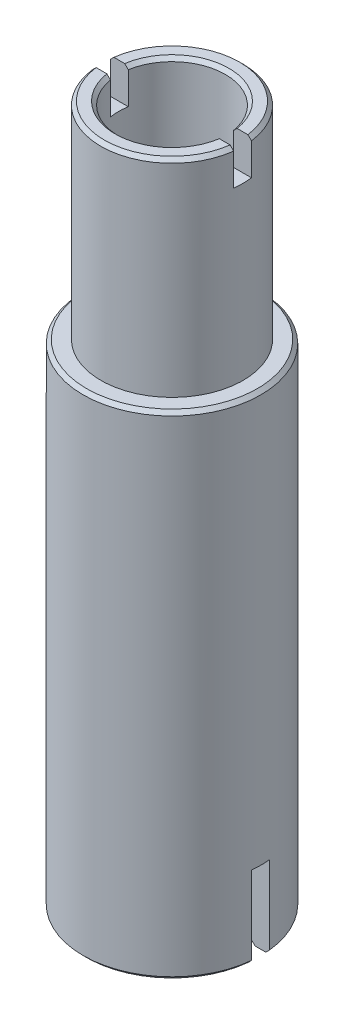
ISO-10303-21;
HEADER;
FILE_DESCRIPTION(('STEP AP214'),'2;1');
FILE_NAME('part.step','',(''),(''),'','','');
FILE_SCHEMA(('AUTOMOTIVE_DESIGN { 1 0 10303 214 1 1 1 1 }'));
ENDSEC;
DATA;
#1=APPLICATION_CONTEXT('core data for automotive mechanical design processes');
#2=APPLICATION_PROTOCOL_DEFINITION('international standard','automotive_design',2000,#1);
#3=PRODUCT_CONTEXT('',#1,'mechanical');
#4=PRODUCT('Part','Part','',(#3));
#5=PRODUCT_RELATED_PRODUCT_CATEGORY('part','',(#4));
#6=PRODUCT_DEFINITION_FORMATION('','',#4);
#7=PRODUCT_DEFINITION_CONTEXT('part definition',#1,'design');
#8=PRODUCT_DEFINITION('design','',#6,#7);
#9=PRODUCT_DEFINITION_SHAPE('','',#8);
#10=(LENGTH_UNIT() NAMED_UNIT(*) SI_UNIT(.MILLI.,.METRE.));
#11=(NAMED_UNIT(*) PLANE_ANGLE_UNIT() SI_UNIT($,.RADIAN.));
#12=(NAMED_UNIT(*) SI_UNIT($,.STERADIAN.) SOLID_ANGLE_UNIT());
#13=UNCERTAINTY_MEASURE_WITH_UNIT(LENGTH_MEASURE(1.E-05),#10,'distance_accuracy_value','');
#14=(GEOMETRIC_REPRESENTATION_CONTEXT(3) GLOBAL_UNCERTAINTY_ASSIGNED_CONTEXT((#13)) GLOBAL_UNIT_ASSIGNED_CONTEXT((#10,
#11,#12)) REPRESENTATION_CONTEXT('',''));
#15=CARTESIAN_POINT('',(0.,0.,0.));
#16=DIRECTION('',(0.,0.,1.));
#17=DIRECTION('',(1.,0.,0.));
#18=AXIS2_PLACEMENT_3D('',#15,#16,#17);
#19=CARTESIAN_POINT('',(20.,-138.5,0.));
#20=DIRECTION('',(0.,-1.,0.));
#21=DIRECTION('',(0.,0.,-1.));
#22=AXIS2_PLACEMENT_3D('',#19,#20,#21);
#23=PLANE('',#22);
#24=DIRECTION('',(1.,0.,0.));
#25=VECTOR('',#24,1.);
#26=CARTESIAN_POINT('',(-35.,-138.5,-2.5));
#27=LINE('',#26,#25);
#28=CARTESIAN_POINT('',(20.850659461993,-138.5,-2.5));
#29=VERTEX_POINT('',#28);
#30=CARTESIAN_POINT('',(23.86943652456,-138.5,-2.5));
#31=VERTEX_POINT('',#30);
#32=EDGE_CURVE('E570',#29,#31,#27,.T.);
#33=ORIENTED_EDGE('',*,*,#32,.F.);
#34=CARTESIAN_POINT('',(0.,-138.5,0.));
#35=DIRECTION('',(0.,-1.,0.));
#36=DIRECTION('',(0.,0.,-1.));
#37=AXIS2_PLACEMENT_3D('',#34,#35,#36);
#38=CIRCLE('',#37,20.9999999999999);
#39=CARTESIAN_POINT('',(-20.850659461993,-138.5,-2.5));
#40=VERTEX_POINT('',#39);
#41=EDGE_CURVE('E301',#29,#40,#38,.F.);
#42=ORIENTED_EDGE('',*,*,#41,.T.);
#43=CARTESIAN_POINT('',(-23.86943652456,-138.5,-2.5));
#44=VERTEX_POINT('',#43);
#45=EDGE_CURVE('E573',#44,#40,#27,.T.);
#46=ORIENTED_EDGE('',*,*,#45,.F.);
#47=CARTESIAN_POINT('',(0.,-138.5,0.));
#48=DIRECTION('',(0.,-1.,0.));
#49=DIRECTION('',(0.,0.,-1.));
#50=AXIS2_PLACEMENT_3D('',#47,#48,#49);
#51=CIRCLE('',#50,24.);
#52=EDGE_CURVE('E641',#44,#31,#51,.T.);
#53=ORIENTED_EDGE('',*,*,#52,.T.);
#54=EDGE_LOOP('',(#33,#42,#46,#53));
#55=FACE_BOUND('',#54,.T.);
#56=ADVANCED_FACE('F34',(#55),#23,.T.);
#57=CARTESIAN_POINT('',(20.,58.,0.));
#58=DIRECTION('',(0.,1.,0.));
#59=DIRECTION('',(0.,0.,1.));
#60=AXIS2_PLACEMENT_3D('',#57,#58,#59);
#61=PLANE('',#60);
#62=DIRECTION('',(1.,0.,0.));
#63=VECTOR('',#62,1.);
#64=CARTESIAN_POINT('',(-27.5,58.,2.5));
#65=LINE('',#64,#63);
#66=CARTESIAN_POINT('',(-18.8348082018373,58.,2.5));
#67=VERTEX_POINT('',#66);
#68=CARTESIAN_POINT('',(-15.8034806292791,58.,2.5));
#69=VERTEX_POINT('',#68);
#70=EDGE_CURVE('E452',#67,#69,#65,.T.);
#71=ORIENTED_EDGE('',*,*,#70,.F.);
#72=CARTESIAN_POINT('',(0.,58.,0.));
#73=DIRECTION('',(0.,1.,0.));
#74=DIRECTION('',(0.,0.,1.));
#75=AXIS2_PLACEMENT_3D('',#72,#73,#74);
#76=CIRCLE('',#75,19.);
#77=CARTESIAN_POINT('',(18.8348082018373,58.,2.5));
#78=VERTEX_POINT('',#77);
#79=EDGE_CURVE('E56',#67,#78,#76,.T.);
#80=ORIENTED_EDGE('',*,*,#79,.T.);
#81=CARTESIAN_POINT('',(15.8034806292791,58.,2.5));
#82=VERTEX_POINT('',#81);
#83=EDGE_CURVE('E453',#82,#78,#65,.T.);
#84=ORIENTED_EDGE('',*,*,#83,.F.);
#85=CARTESIAN_POINT('',(0.,58.,0.));
#86=DIRECTION('',(0.,1.,0.));
#87=DIRECTION('',(0.,0.,1.));
#88=AXIS2_PLACEMENT_3D('',#85,#86,#87);
#89=CIRCLE('',#88,16.);
#90=EDGE_CURVE('E438',#82,#69,#89,.F.);
#91=ORIENTED_EDGE('',*,*,#90,.T.);
#92=EDGE_LOOP('',(#71,#80,#84,#91));
#93=FACE_BOUND('',#92,.T.);
#94=ADVANCED_FACE('F341',(#93),#61,.T.);
#95=CARTESIAN_POINT('',(0.,0.,0.));
#96=DIRECTION('',(0.,-1.,0.));
#97=DIRECTION('',(0.,0.,-1.));
#98=AXIS2_PLACEMENT_3D('',#95,#96,#97);
#99=CYLINDRICAL_SURFACE('',#98,20.);
#100=DIRECTION('',(0.,-1.,0.));
#101=VECTOR('',#100,1.);
#102=CARTESIAN_POINT('',(-19.8431348329844,0.,-2.5));
#103=LINE('',#102,#101);
#104=CARTESIAN_POINT('',(-19.8431348329844,-137.5,-2.5));
#105=VERTEX_POINT('',#104);
#106=CARTESIAN_POINT('',(-19.8431348329844,-115.5,-2.5));
#107=VERTEX_POINT('',#106);
#108=EDGE_CURVE('E224',#105,#107,#103,.F.);
#109=ORIENTED_EDGE('',*,*,#108,.F.);
#110=CARTESIAN_POINT('',(0.,-137.5,0.));
#111=DIRECTION('',(0.,-1.,0.));
#112=DIRECTION('',(0.,0.,-1.));
#113=AXIS2_PLACEMENT_3D('',#110,#111,#112);
#114=CIRCLE('',#113,20.);
#115=CARTESIAN_POINT('',(19.8431348329844,-137.5,-2.5));
#116=VERTEX_POINT('',#115);
#117=EDGE_CURVE('E258',#105,#116,#114,.T.);
#118=ORIENTED_EDGE('',*,*,#117,.T.);
#119=DIRECTION('',(0.,-1.,0.));
#120=VECTOR('',#119,1.);
#121=CARTESIAN_POINT('',(19.8431348329844,0.,-2.5));
#122=LINE('',#121,#120);
#123=CARTESIAN_POINT('',(19.8431348329844,-115.5,-2.5));
#124=VERTEX_POINT('',#123);
#125=EDGE_CURVE('E581',#124,#116,#122,.T.);
#126=ORIENTED_EDGE('',*,*,#125,.F.);
#127=CARTESIAN_POINT('',(0.,-115.5,0.));
#128=DIRECTION('',(0.,-1.,0.));
#129=DIRECTION('',(0.,0.,-1.));
#130=AXIS2_PLACEMENT_3D('',#127,#128,#129);
#131=CIRCLE('',#130,20.);
#132=CARTESIAN_POINT('',(19.8431348329844,-115.5,2.5));
#133=VERTEX_POINT('',#132);
#134=EDGE_CURVE('E513',#124,#133,#131,.T.);
#135=ORIENTED_EDGE('',*,*,#134,.T.);
#136=DIRECTION('',(0.,-1.,0.));
#137=VECTOR('',#136,1.);
#138=CARTESIAN_POINT('',(19.8431348329844,0.,2.5));
#139=LINE('',#138,#137);
#140=CARTESIAN_POINT('',(19.8431348329844,-137.5,2.5));
#141=VERTEX_POINT('',#140);
#142=EDGE_CURVE('E576',#141,#133,#139,.F.);
#143=ORIENTED_EDGE('',*,*,#142,.F.);
#144=CARTESIAN_POINT('',(0.,-137.5,0.));
#145=DIRECTION('',(0.,-1.,0.));
#146=DIRECTION('',(0.,0.,-1.));
#147=AXIS2_PLACEMENT_3D('',#144,#145,#146);
#148=CIRCLE('',#147,20.);
#149=CARTESIAN_POINT('',(-19.8431348329844,-137.5,2.5));
#150=VERTEX_POINT('',#149);
#151=EDGE_CURVE('E255',#141,#150,#148,.T.);
#152=ORIENTED_EDGE('',*,*,#151,.T.);
#153=DIRECTION('',(0.,-1.,0.));
#154=VECTOR('',#153,1.);
#155=CARTESIAN_POINT('',(-19.8431348329844,0.,2.5));
#156=LINE('',#155,#154);
#157=CARTESIAN_POINT('',(-19.8431348329844,-115.5,2.5));
#158=VERTEX_POINT('',#157);
#159=EDGE_CURVE('E578',#158,#150,#156,.T.);
#160=ORIENTED_EDGE('',*,*,#159,.F.);
#161=EDGE_CURVE('E225',#158,#107,#131,.T.);
#162=ORIENTED_EDGE('',*,*,#161,.T.);
#163=EDGE_LOOP('',(#109,#118,#126,#135,#143,#152,#160,#162));
#164=FACE_BOUND('',#163,.T.);
#165=CARTESIAN_POINT('',(0.,-50.,0.));
#166=DIRECTION('',(0.,-1.,0.));
#167=DIRECTION('',(0.,0.,-1.));
#168=AXIS2_PLACEMENT_3D('',#165,#166,#167);
#169=CIRCLE('',#168,20.);
#170=CARTESIAN_POINT('',(0.,-50.,-20.));
#171=VERTEX_POINT('',#170);
#172=EDGE_CURVE('E481',#171,#171,#169,.T.);
#173=ORIENTED_EDGE('',*,*,#172,.F.);
#174=EDGE_LOOP('',(#173));
#175=FACE_BOUND('',#174,.T.);
#176=ADVANCED_FACE('F337',(#164,#175),#99,.F.);
#177=DIRECTION('',(-1.,0.,0.));
#178=VECTOR('',#177,1.);
#179=CARTESIAN_POINT('',(-35.,-138.5,2.5));
#180=LINE('',#179,#178);
#181=CARTESIAN_POINT('',(-20.850659461993,-138.5,2.5));
#182=VERTEX_POINT('',#181);
#183=CARTESIAN_POINT('',(-23.86943652456,-138.5,2.5));
#184=VERTEX_POINT('',#183);
#185=EDGE_CURVE('E564',#182,#184,#180,.T.);
#186=ORIENTED_EDGE('',*,*,#185,.F.);
#187=CARTESIAN_POINT('',(0.,-138.5,0.));
#188=DIRECTION('',(0.,-1.,0.));
#189=DIRECTION('',(0.,0.,-1.));
#190=AXIS2_PLACEMENT_3D('',#187,#188,#189);
#191=CIRCLE('',#190,20.9999999999999);
#192=CARTESIAN_POINT('',(20.850659461993,-138.5,2.5));
#193=VERTEX_POINT('',#192);
#194=EDGE_CURVE('E528',#182,#193,#191,.F.);
#195=ORIENTED_EDGE('',*,*,#194,.T.);
#196=CARTESIAN_POINT('',(23.86943652456,-138.5,2.5));
#197=VERTEX_POINT('',#196);
#198=EDGE_CURVE('E566',#197,#193,#180,.T.);
#199=ORIENTED_EDGE('',*,*,#198,.F.);
#200=CARTESIAN_POINT('',(0.,-138.5,0.));
#201=DIRECTION('',(0.,-1.,0.));
#202=DIRECTION('',(0.,0.,-1.));
#203=AXIS2_PLACEMENT_3D('',#200,#201,#202);
#204=CIRCLE('',#203,24.);
#205=EDGE_CURVE('E526',#197,#184,#204,.T.);
#206=ORIENTED_EDGE('',*,*,#205,.T.);
#207=EDGE_LOOP('',(#186,#195,#199,#206));
#208=FACE_BOUND('',#207,.T.);
#209=ADVANCED_FACE('F340',(#208),#23,.T.);
#210=CARTESIAN_POINT('',(0.,0.,0.));
#211=DIRECTION('',(0.,-1.,0.));
#212=DIRECTION('',(0.,0.,-1.));
#213=AXIS2_PLACEMENT_3D('',#210,#211,#212);
#214=CYLINDRICAL_SURFACE('',#213,25.);
#215=CARTESIAN_POINT('',(0.,-1.00000000000003,0.));
#216=DIRECTION('',(0.,1.,0.));
#217=DIRECTION('',(0.,0.,1.));
#218=AXIS2_PLACEMENT_3D('',#215,#216,#217);
#219=CIRCLE('',#218,25.);
#220=CARTESIAN_POINT('',(0.,-1.00000000000003,25.));
#221=VERTEX_POINT('',#220);
#222=EDGE_CURVE('E249',#221,#221,#219,.F.);
#223=ORIENTED_EDGE('',*,*,#222,.T.);
#224=EDGE_LOOP('',(#223));
#225=FACE_BOUND('',#224,.T.);
#226=DIRECTION('',(0.,-1.,0.));
#227=VECTOR('',#226,1.);
#228=CARTESIAN_POINT('',(24.8746859276655,0.,-2.5));
#229=LINE('',#228,#227);
#230=CARTESIAN_POINT('',(24.8746859276655,-137.5,-2.5));
#231=VERTEX_POINT('',#230);
#232=CARTESIAN_POINT('',(24.8746859276655,-115.5,-2.5));
#233=VERTEX_POINT('',#232);
#234=EDGE_CURVE('E214',#231,#233,#229,.F.);
#235=ORIENTED_EDGE('',*,*,#234,.F.);
#236=CARTESIAN_POINT('',(0.,-137.5,0.));
#237=DIRECTION('',(0.,-1.,0.));
#238=DIRECTION('',(0.,0.,-1.));
#239=AXIS2_PLACEMENT_3D('',#236,#237,#238);
#240=CIRCLE('',#239,25.);
#241=CARTESIAN_POINT('',(-24.8746859276655,-137.5,-2.5));
#242=VERTEX_POINT('',#241);
#243=EDGE_CURVE('E231',#231,#242,#240,.F.);
#244=ORIENTED_EDGE('',*,*,#243,.T.);
#245=DIRECTION('',(0.,-1.,0.));
#246=VECTOR('',#245,1.);
#247=CARTESIAN_POINT('',(-24.8746859276655,0.,-2.5));
#248=LINE('',#247,#246);
#249=CARTESIAN_POINT('',(-24.8746859276655,-115.5,-2.5));
#250=VERTEX_POINT('',#249);
#251=EDGE_CURVE('E221',#250,#242,#248,.T.);
#252=ORIENTED_EDGE('',*,*,#251,.F.);
#253=CARTESIAN_POINT('',(0.,-115.5,0.));
#254=DIRECTION('',(0.,-1.,0.));
#255=DIRECTION('',(0.,0.,-1.));
#256=AXIS2_PLACEMENT_3D('',#253,#254,#255);
#257=CIRCLE('',#256,25.);
#258=CARTESIAN_POINT('',(-24.8746859276655,-115.5,2.5));
#259=VERTEX_POINT('',#258);
#260=EDGE_CURVE('E203',#250,#259,#257,.F.);
#261=ORIENTED_EDGE('',*,*,#260,.T.);
#262=DIRECTION('',(0.,-1.,0.));
#263=VECTOR('',#262,1.);
#264=CARTESIAN_POINT('',(-24.8746859276655,0.,2.5));
#265=LINE('',#264,#263);
#266=CARTESIAN_POINT('',(-24.8746859276655,-137.5,2.5));
#267=VERTEX_POINT('',#266);
#268=EDGE_CURVE('E213',#267,#259,#265,.F.);
#269=ORIENTED_EDGE('',*,*,#268,.F.);
#270=CARTESIAN_POINT('',(0.,-137.5,0.));
#271=DIRECTION('',(0.,-1.,0.));
#272=DIRECTION('',(0.,0.,-1.));
#273=AXIS2_PLACEMENT_3D('',#270,#271,#272);
#274=CIRCLE('',#273,25.);
#275=CARTESIAN_POINT('',(24.8746859276655,-137.5,2.5));
#276=VERTEX_POINT('',#275);
#277=EDGE_CURVE('E246',#267,#276,#274,.F.);
#278=ORIENTED_EDGE('',*,*,#277,.T.);
#279=DIRECTION('',(0.,-1.,0.));
#280=VECTOR('',#279,1.);
#281=CARTESIAN_POINT('',(24.8746859276655,0.,2.5));
#282=LINE('',#281,#280);
#283=CARTESIAN_POINT('',(24.8746859276655,-115.5,2.5));
#284=VERTEX_POINT('',#283);
#285=EDGE_CURVE('E500',#284,#276,#282,.T.);
#286=ORIENTED_EDGE('',*,*,#285,.F.);
#287=EDGE_CURVE('E216',#284,#233,#257,.F.);
#288=ORIENTED_EDGE('',*,*,#287,.T.);
#289=EDGE_LOOP('',(#235,#244,#252,#261,#269,#278,#286,#288));
#290=FACE_BOUND('',#289,.T.);
#291=ADVANCED_FACE('F229',(#225,#290),#214,.T.);
#292=CARTESIAN_POINT('',(25.,0.,0.));
#293=DIRECTION('',(0.,1.,0.));
#294=DIRECTION('',(0.,0.,1.));
#295=AXIS2_PLACEMENT_3D('',#292,#293,#294);
#296=PLANE('',#295);
#297=CARTESIAN_POINT('',(0.,0.,0.));
#298=DIRECTION('',(0.,1.,0.));
#299=DIRECTION('',(0.,0.,1.));
#300=AXIS2_PLACEMENT_3D('',#297,#298,#299);
#301=CIRCLE('',#300,24.);
#302=CARTESIAN_POINT('',(0.,0.,24.));
#303=VERTEX_POINT('',#302);
#304=EDGE_CURVE('E252',#303,#303,#301,.T.);
#305=ORIENTED_EDGE('',*,*,#304,.T.);
#306=EDGE_LOOP('',(#305));
#307=FACE_BOUND('',#306,.T.);
#308=CARTESIAN_POINT('',(0.,0.,0.));
#309=DIRECTION('',(0.,-1.,0.));
#310=DIRECTION('',(0.,0.,-1.));
#311=AXIS2_PLACEMENT_3D('',#308,#309,#310);
#312=CIRCLE('',#311,20.);
#313=CARTESIAN_POINT('',(0.,0.,-20.));
#314=VERTEX_POINT('',#313);
#315=EDGE_CURVE('E484',#314,#314,#312,.T.);
#316=ORIENTED_EDGE('',*,*,#315,.T.);
#317=EDGE_LOOP('',(#316));
#318=FACE_BOUND('',#317,.T.);
#319=ADVANCED_FACE('F348',(#307,#318),#296,.T.);
#320=CARTESIAN_POINT('',(0.,0.,0.));
#321=DIRECTION('',(0.,-1.,0.));
#322=DIRECTION('',(0.,0.,-1.));
#323=AXIS2_PLACEMENT_3D('',#320,#321,#322);
#324=CYLINDRICAL_SURFACE('',#323,20.);
#325=DIRECTION('',(0.,-1.,0.));
#326=VECTOR('',#325,1.);
#327=CARTESIAN_POINT('',(-19.8431348329844,0.,-2.5));
#328=LINE('',#327,#326);
#329=CARTESIAN_POINT('',(-19.8431348329844,57.,-2.5));
#330=VERTEX_POINT('',#329);
#331=CARTESIAN_POINT('',(-19.8431348329844,48.,-2.5));
#332=VERTEX_POINT('',#331);
#333=EDGE_CURVE('E472',#330,#332,#328,.T.);
#334=ORIENTED_EDGE('',*,*,#333,.F.);
#335=CARTESIAN_POINT('',(0.,57.,0.));
#336=DIRECTION('',(0.,1.,0.));
#337=DIRECTION('',(0.,0.,1.));
#338=AXIS2_PLACEMENT_3D('',#335,#336,#337);
#339=CIRCLE('',#338,20.);
#340=CARTESIAN_POINT('',(19.8431348329844,57.,-2.5));
#341=VERTEX_POINT('',#340);
#342=EDGE_CURVE('E610',#330,#341,#339,.F.);
#343=ORIENTED_EDGE('',*,*,#342,.T.);
#344=DIRECTION('',(0.,-1.,0.));
#345=VECTOR('',#344,1.);
#346=CARTESIAN_POINT('',(19.8431348329844,0.,-2.5));
#347=LINE('',#346,#345);
#348=CARTESIAN_POINT('',(19.8431348329844,48.,-2.5));
#349=VERTEX_POINT('',#348);
#350=EDGE_CURVE('E474',#349,#341,#347,.F.);
#351=ORIENTED_EDGE('',*,*,#350,.F.);
#352=CARTESIAN_POINT('',(0.,48.,0.));
#353=DIRECTION('',(0.,-1.,0.));
#354=DIRECTION('',(0.,0.,-1.));
#355=AXIS2_PLACEMENT_3D('',#352,#353,#354);
#356=CIRCLE('',#355,20.);
#357=CARTESIAN_POINT('',(19.8431348329844,48.,2.5));
#358=VERTEX_POINT('',#357);
#359=EDGE_CURVE('E468',#358,#349,#356,.F.);
#360=ORIENTED_EDGE('',*,*,#359,.F.);
#361=DIRECTION('',(0.,-1.,0.));
#362=VECTOR('',#361,1.);
#363=CARTESIAN_POINT('',(19.8431348329844,0.,2.5));
#364=LINE('',#363,#362);
#365=CARTESIAN_POINT('',(19.8431348329844,57.,2.5));
#366=VERTEX_POINT('',#365);
#367=EDGE_CURVE('E477',#366,#358,#364,.T.);
#368=ORIENTED_EDGE('',*,*,#367,.F.);
#369=CARTESIAN_POINT('',(0.,57.,0.));
#370=DIRECTION('',(0.,1.,0.));
#371=DIRECTION('',(0.,0.,1.));
#372=AXIS2_PLACEMENT_3D('',#369,#370,#371);
#373=CIRCLE('',#372,20.);
#374=CARTESIAN_POINT('',(-19.8431348329844,57.,2.5));
#375=VERTEX_POINT('',#374);
#376=EDGE_CURVE('E530',#366,#375,#373,.F.);
#377=ORIENTED_EDGE('',*,*,#376,.T.);
#378=DIRECTION('',(0.,-1.,0.));
#379=VECTOR('',#378,1.);
#380=CARTESIAN_POINT('',(-19.8431348329844,0.,2.5));
#381=LINE('',#380,#379);
#382=CARTESIAN_POINT('',(-19.8431348329844,48.,2.5));
#383=VERTEX_POINT('',#382);
#384=EDGE_CURVE('E479',#383,#375,#381,.F.);
#385=ORIENTED_EDGE('',*,*,#384,.F.);
#386=EDGE_CURVE('E470',#332,#383,#356,.F.);
#387=ORIENTED_EDGE('',*,*,#386,.F.);
#388=EDGE_LOOP('',(#334,#343,#351,#360,#368,#377,#385,#387));
#389=FACE_BOUND('',#388,.T.);
#390=ORIENTED_EDGE('',*,*,#315,.F.);
#391=EDGE_LOOP('',(#390));
#392=FACE_BOUND('',#391,.T.);
#393=ADVANCED_FACE('F352',(#389,#392),#324,.T.);
#394=DIRECTION('',(-1.,0.,0.));
#395=VECTOR('',#394,1.);
#396=CARTESIAN_POINT('',(-27.5,58.,-2.5));
#397=LINE('',#396,#395);
#398=CARTESIAN_POINT('',(18.8348082018373,58.,-2.5));
#399=VERTEX_POINT('',#398);
#400=CARTESIAN_POINT('',(15.8034806292791,58.,-2.5));
#401=VERTEX_POINT('',#400);
#402=EDGE_CURVE('E463',#399,#401,#397,.T.);
#403=ORIENTED_EDGE('',*,*,#402,.F.);
#404=CARTESIAN_POINT('',(0.,58.,0.));
#405=DIRECTION('',(0.,1.,0.));
#406=DIRECTION('',(0.,0.,1.));
#407=AXIS2_PLACEMENT_3D('',#404,#405,#406);
#408=CIRCLE('',#407,19.);
#409=CARTESIAN_POINT('',(-18.8348082018373,58.,-2.5));
#410=VERTEX_POINT('',#409);
#411=EDGE_CURVE('E406',#399,#410,#408,.T.);
#412=ORIENTED_EDGE('',*,*,#411,.T.);
#413=CARTESIAN_POINT('',(-15.8034806292791,58.,-2.5));
#414=VERTEX_POINT('',#413);
#415=EDGE_CURVE('E466',#414,#410,#397,.T.);
#416=ORIENTED_EDGE('',*,*,#415,.F.);
#417=CARTESIAN_POINT('',(0.,58.,0.));
#418=DIRECTION('',(0.,1.,0.));
#419=DIRECTION('',(0.,0.,1.));
#420=AXIS2_PLACEMENT_3D('',#417,#418,#419);
#421=CIRCLE('',#420,16.);
#422=EDGE_CURVE('E623',#414,#401,#421,.F.);
#423=ORIENTED_EDGE('',*,*,#422,.T.);
#424=EDGE_LOOP('',(#403,#412,#416,#423));
#425=FACE_BOUND('',#424,.T.);
#426=ADVANCED_FACE('F356',(#425),#61,.T.);
#427=CARTESIAN_POINT('',(0.,0.,0.));
#428=DIRECTION('',(0.,-1.,0.));
#429=DIRECTION('',(0.,0.,-1.));
#430=AXIS2_PLACEMENT_3D('',#427,#428,#429);
#431=CYLINDRICAL_SURFACE('',#430,15.);
#432=CARTESIAN_POINT('',(0.,-49.,0.));
#433=DIRECTION('',(0.,-1.,0.));
#434=DIRECTION('',(0.,0.,-1.));
#435=AXIS2_PLACEMENT_3D('',#432,#433,#434);
#436=CIRCLE('',#435,15.);
#437=CARTESIAN_POINT('',(0.,-49.,-15.));
#438=VERTEX_POINT('',#437);
#439=EDGE_CURVE('E240',#438,#438,#436,.T.);
#440=ORIENTED_EDGE('',*,*,#439,.T.);
#441=EDGE_LOOP('',(#440));
#442=FACE_BOUND('',#441,.T.);
#443=DIRECTION('',(0.,-1.,0.));
#444=VECTOR('',#443,1.);
#445=CARTESIAN_POINT('',(14.790199457749,0.,-2.5));
#446=LINE('',#445,#444);
#447=CARTESIAN_POINT('',(14.790199457749,57.,-2.5));
#448=VERTEX_POINT('',#447);
#449=CARTESIAN_POINT('',(14.790199457749,48.,-2.5));
#450=VERTEX_POINT('',#449);
#451=EDGE_CURVE('E495',#448,#450,#446,.T.);
#452=ORIENTED_EDGE('',*,*,#451,.F.);
#453=CARTESIAN_POINT('',(0.,57.,0.));
#454=DIRECTION('',(0.,1.,0.));
#455=DIRECTION('',(0.,0.,1.));
#456=AXIS2_PLACEMENT_3D('',#453,#454,#455);
#457=CIRCLE('',#456,15.);
#458=CARTESIAN_POINT('',(-14.790199457749,57.,-2.5));
#459=VERTEX_POINT('',#458);
#460=EDGE_CURVE('E234',#448,#459,#457,.T.);
#461=ORIENTED_EDGE('',*,*,#460,.T.);
#462=DIRECTION('',(0.,-1.,0.));
#463=VECTOR('',#462,1.);
#464=CARTESIAN_POINT('',(-14.790199457749,0.,-2.5));
#465=LINE('',#464,#463);
#466=CARTESIAN_POINT('',(-14.790199457749,48.,-2.5));
#467=VERTEX_POINT('',#466);
#468=EDGE_CURVE('E489',#467,#459,#465,.F.);
#469=ORIENTED_EDGE('',*,*,#468,.F.);
#470=CARTESIAN_POINT('',(0.,48.,0.));
#471=DIRECTION('',(0.,-1.,0.));
#472=DIRECTION('',(0.,0.,-1.));
#473=AXIS2_PLACEMENT_3D('',#470,#471,#472);
#474=CIRCLE('',#473,15.);
#475=CARTESIAN_POINT('',(-14.790199457749,48.,2.5));
#476=VERTEX_POINT('',#475);
#477=EDGE_CURVE('E487',#476,#467,#474,.T.);
#478=ORIENTED_EDGE('',*,*,#477,.F.);
#479=DIRECTION('',(0.,-1.,0.));
#480=VECTOR('',#479,1.);
#481=CARTESIAN_POINT('',(-14.790199457749,0.,2.5));
#482=LINE('',#481,#480);
#483=CARTESIAN_POINT('',(-14.790199457749,57.,2.5));
#484=VERTEX_POINT('',#483);
#485=EDGE_CURVE('E493',#484,#476,#482,.T.);
#486=ORIENTED_EDGE('',*,*,#485,.F.);
#487=CARTESIAN_POINT('',(0.,57.,0.));
#488=DIRECTION('',(0.,1.,0.));
#489=DIRECTION('',(0.,0.,1.));
#490=AXIS2_PLACEMENT_3D('',#487,#488,#489);
#491=CIRCLE('',#490,15.);
#492=CARTESIAN_POINT('',(14.790199457749,57.,2.5));
#493=VERTEX_POINT('',#492);
#494=EDGE_CURVE('E232',#484,#493,#491,.T.);
#495=ORIENTED_EDGE('',*,*,#494,.T.);
#496=DIRECTION('',(0.,-1.,0.));
#497=VECTOR('',#496,1.);
#498=CARTESIAN_POINT('',(14.790199457749,0.,2.5));
#499=LINE('',#498,#497);
#500=CARTESIAN_POINT('',(14.790199457749,48.,2.5));
#501=VERTEX_POINT('',#500);
#502=EDGE_CURVE('E497',#501,#493,#499,.F.);
#503=ORIENTED_EDGE('',*,*,#502,.F.);
#504=EDGE_CURVE('E490',#450,#501,#474,.T.);
#505=ORIENTED_EDGE('',*,*,#504,.F.);
#506=EDGE_LOOP('',(#452,#461,#469,#478,#486,#495,#503,#505));
#507=FACE_BOUND('',#506,.T.);
#508=ADVANCED_FACE('F360',(#442,#507),#431,.F.);
#509=CARTESIAN_POINT('',(15.,-50.,0.));
#510=DIRECTION('',(0.,-1.,0.));
#511=DIRECTION('',(0.,0.,-1.));
#512=AXIS2_PLACEMENT_3D('',#509,#510,#511);
#513=PLANE('',#512);
#514=CARTESIAN_POINT('',(0.,-50.,0.));
#515=DIRECTION('',(0.,-1.,0.));
#516=DIRECTION('',(0.,0.,-1.));
#517=AXIS2_PLACEMENT_3D('',#514,#515,#516);
#518=CIRCLE('',#517,16.);
#519=CARTESIAN_POINT('',(0.,-50.,-16.));
#520=VERTEX_POINT('',#519);
#521=EDGE_CURVE('E243',#520,#520,#518,.F.);
#522=ORIENTED_EDGE('',*,*,#521,.T.);
#523=EDGE_LOOP('',(#522));
#524=FACE_BOUND('',#523,.T.);
#525=ORIENTED_EDGE('',*,*,#172,.T.);
#526=EDGE_LOOP('',(#525));
#527=FACE_BOUND('',#526,.T.);
#528=ADVANCED_FACE('F364',(#524,#527),#513,.T.);
#529=CARTESIAN_POINT('',(0.,48.,0.));
#530=DIRECTION('',(0.,-1.,0.));
#531=DIRECTION('',(0.,0.,-1.));
#532=AXIS2_PLACEMENT_3D('',#529,#530,#531);
#533=PLANE('',#532);
#534=ORIENTED_EDGE('',*,*,#386,.T.);
#535=DIRECTION('',(1.,0.,0.));
#536=VECTOR('',#535,1.);
#537=CARTESIAN_POINT('',(-27.5,48.,2.5));
#538=LINE('',#537,#536);
#539=EDGE_CURVE('E471',#383,#476,#538,.T.);
#540=ORIENTED_EDGE('',*,*,#539,.T.);
#541=ORIENTED_EDGE('',*,*,#477,.T.);
#542=DIRECTION('',(-1.,0.,0.));
#543=VECTOR('',#542,1.);
#544=CARTESIAN_POINT('',(-27.5,48.,-2.5));
#545=LINE('',#544,#543);
#546=EDGE_CURVE('E458',#467,#332,#545,.T.);
#547=ORIENTED_EDGE('',*,*,#546,.T.);
#548=EDGE_LOOP('',(#534,#540,#541,#547));
#549=FACE_BOUND('',#548,.T.);
#550=ADVANCED_FACE('F368',(#549),#533,.F.);
#551=CARTESIAN_POINT('',(-27.5,48.,-2.5));
#552=DIRECTION('',(0.,0.,-1.));
#553=DIRECTION('',(-1.,0.,0.));
#554=AXIS2_PLACEMENT_3D('',#551,#552,#553);
#555=PLANE('',#554);
#556=ORIENTED_EDGE('',*,*,#415,.T.);
#557=CARTESIAN_POINT('',(-18.8348082018373,58.,-2.5));
#558=CARTESIAN_POINT('',(-19.0028983712245,57.8333693616147,-2.5));
#559=CARTESIAN_POINT('',(-19.1709706752051,57.6667207090642,-2.5));
#560=CARTESIAN_POINT('',(-19.5070795522541,57.3333873757308,-2.5));
#561=CARTESIAN_POINT('',(-19.6751161253226,57.166702694948,-2.5));
#562=CARTESIAN_POINT('',(-19.8431348329844,57.,-2.5));
#563=B_SPLINE_CURVE_WITH_KNOTS('',3,(#557,#558,#559,#560,#561,#562),.UNSPECIFIED.,.F.,.F.,(4,2,
4),(0.,0.710056796925677,1.42011359343296),.UNSPECIFIED.);
#564=EDGE_CURVE('E405',#410,#330,#563,.T.);
#565=ORIENTED_EDGE('',*,*,#564,.T.);
#566=ORIENTED_EDGE('',*,*,#333,.T.);
#567=ORIENTED_EDGE('',*,*,#546,.F.);
#568=ORIENTED_EDGE('',*,*,#468,.T.);
#569=CARTESIAN_POINT('',(-14.790199457749,57.,-2.5));
#570=CARTESIAN_POINT('',(-14.9591515253217,57.166593840307,-2.5));
#571=CARTESIAN_POINT('',(-15.1280676568622,57.3332240939188,-2.5));
#572=CARTESIAN_POINT('',(-15.465828047372,57.6665574272524,-2.5));
#573=CARTESIAN_POINT('',(-15.6346723063416,57.8332605069739,-2.5));
#574=CARTESIAN_POINT('',(-15.8034806292791,58.,-2.5));
#575=B_SPLINE_CURVE_WITH_KNOTS('',3,(#569,#570,#571,#572,#573,#574),.UNSPECIFIED.,.F.,.F.,(4,2,
4),(0.,0.711817889786455,1.42363577743788),.UNSPECIFIED.);
#576=EDGE_CURVE('E399',#459,#414,#575,.T.);
#577=ORIENTED_EDGE('',*,*,#576,.T.);
#578=EDGE_LOOP('',(#556,#565,#566,#567,#568,#577));
#579=FACE_BOUND('',#578,.T.);
#580=ADVANCED_FACE('F370',(#579),#555,.F.);
#581=CARTESIAN_POINT('',(-27.5,48.,2.5));
#582=DIRECTION('',(0.,0.,1.));
#583=DIRECTION('',(1.,0.,0.));
#584=AXIS2_PLACEMENT_3D('',#581,#582,#583);
#585=PLANE('',#584);
#586=ORIENTED_EDGE('',*,*,#384,.T.);
#587=CARTESIAN_POINT('',(-19.8431348329844,57.,2.5));
#588=CARTESIAN_POINT('',(-19.6751161253226,57.166702694948,2.5));
#589=CARTESIAN_POINT('',(-19.5070795522541,57.3333873757308,2.5));
#590=CARTESIAN_POINT('',(-19.1709706752051,57.6667207090642,2.5));
#591=CARTESIAN_POINT('',(-19.0028983712245,57.8333693616147,2.5));
#592=CARTESIAN_POINT('',(-18.8348082018373,58.,2.5));
#593=B_SPLINE_CURVE_WITH_KNOTS('',3,(#587,#588,#589,#590,#591,#592),.UNSPECIFIED.,.F.,.F.,(4,2,
4),(0.,0.710056796507283,1.42011359343296),.UNSPECIFIED.);
#594=EDGE_CURVE('E432',#375,#67,#593,.T.);
#595=ORIENTED_EDGE('',*,*,#594,.T.);
#596=ORIENTED_EDGE('',*,*,#70,.T.);
#597=CARTESIAN_POINT('',(-15.8034806292791,58.,2.5));
#598=CARTESIAN_POINT('',(-15.6346723063416,57.8332605069739,2.5));
#599=CARTESIAN_POINT('',(-15.465828047372,57.6665574272524,2.5));
#600=CARTESIAN_POINT('',(-15.1280676568622,57.3332240939188,2.5));
#601=CARTESIAN_POINT('',(-14.9591515253217,57.166593840307,2.5));
#602=CARTESIAN_POINT('',(-14.790199457749,57.,2.5));
#603=B_SPLINE_CURVE_WITH_KNOTS('',3,(#597,#598,#599,#600,#601,#602),.UNSPECIFIED.,.F.,.F.,(4,2,
4),(0.,0.711817887651417,1.42363577743787),.UNSPECIFIED.);
#604=EDGE_CURVE('E439',#69,#484,#603,.T.);
#605=ORIENTED_EDGE('',*,*,#604,.T.);
#606=ORIENTED_EDGE('',*,*,#485,.T.);
#607=ORIENTED_EDGE('',*,*,#539,.F.);
#608=EDGE_LOOP('',(#586,#595,#596,#605,#606,#607));
#609=FACE_BOUND('',#608,.T.);
#610=ADVANCED_FACE('F373',(#609),#585,.F.);
#611=ORIENTED_EDGE('',*,*,#350,.T.);
#612=CARTESIAN_POINT('',(19.8431348329844,57.,-2.5));
#613=CARTESIAN_POINT('',(19.6751161253226,57.166702694948,-2.5));
#614=CARTESIAN_POINT('',(19.5070795522541,57.3333873757308,-2.5));
#615=CARTESIAN_POINT('',(19.1709706752051,57.6667207090642,-2.5));
#616=CARTESIAN_POINT('',(19.0028983712245,57.8333693616147,-2.5));
#617=CARTESIAN_POINT('',(18.8348082018373,58.,-2.5));
#618=B_SPLINE_CURVE_WITH_KNOTS('',3,(#612,#613,#614,#615,#616,#617),.UNSPECIFIED.,.F.,.F.,(4,2,
4),(0.,0.710056796507283,1.42011359343296),.UNSPECIFIED.);
#619=EDGE_CURVE('E391',#341,#399,#618,.T.);
#620=ORIENTED_EDGE('',*,*,#619,.T.);
#621=ORIENTED_EDGE('',*,*,#402,.T.);
#622=CARTESIAN_POINT('',(15.8034806292791,58.,-2.5));
#623=CARTESIAN_POINT('',(15.6346723063416,57.8332605069739,-2.5));
#624=CARTESIAN_POINT('',(15.465828047372,57.6665574272524,-2.5));
#625=CARTESIAN_POINT('',(15.1280676568622,57.3332240939188,-2.5));
#626=CARTESIAN_POINT('',(14.9591515253217,57.166593840307,-2.5));
#627=CARTESIAN_POINT('',(14.790199457749,57.,-2.5));
#628=B_SPLINE_CURVE_WITH_KNOTS('',3,(#622,#623,#624,#625,#626,#627),.UNSPECIFIED.,.F.,.F.,(4,2,
4),(0.,0.711817887651415,1.42363577743787),.UNSPECIFIED.);
#629=EDGE_CURVE('E381',#401,#448,#628,.T.);
#630=ORIENTED_EDGE('',*,*,#629,.T.);
#631=ORIENTED_EDGE('',*,*,#451,.T.);
#632=EDGE_CURVE('E461',#349,#450,#545,.T.);
#633=ORIENTED_EDGE('',*,*,#632,.F.);
#634=EDGE_LOOP('',(#611,#620,#621,#630,#631,#633));
#635=FACE_BOUND('',#634,.T.);
#636=ADVANCED_FACE('F375',(#635),#555,.F.);
#637=ORIENTED_EDGE('',*,*,#359,.T.);
#638=ORIENTED_EDGE('',*,*,#632,.T.);
#639=ORIENTED_EDGE('',*,*,#504,.T.);
#640=EDGE_CURVE('E582',#501,#358,#538,.T.);
#641=ORIENTED_EDGE('',*,*,#640,.T.);
#642=EDGE_LOOP('',(#637,#638,#639,#641));
#643=FACE_BOUND('',#642,.T.);
#644=ADVANCED_FACE('F591',(#643),#533,.F.);
#645=ORIENTED_EDGE('',*,*,#83,.T.);
#646=CARTESIAN_POINT('',(18.8348082018373,58.,2.5));
#647=CARTESIAN_POINT('',(19.0028983712245,57.8333693616147,2.5));
#648=CARTESIAN_POINT('',(19.1709706752051,57.6667207090642,2.5));
#649=CARTESIAN_POINT('',(19.5070795522541,57.3333873757308,2.5));
#650=CARTESIAN_POINT('',(19.6751161253226,57.166702694948,2.5));
#651=CARTESIAN_POINT('',(19.8431348329844,57.,2.5));
#652=B_SPLINE_CURVE_WITH_KNOTS('',3,(#646,#647,#648,#649,#650,#651),.UNSPECIFIED.,.F.,.F.,(4,2,
4),(0.,0.710056796925677,1.42011359343296),.UNSPECIFIED.);
#653=EDGE_CURVE('E11',#78,#366,#652,.T.);
#654=ORIENTED_EDGE('',*,*,#653,.T.);
#655=ORIENTED_EDGE('',*,*,#367,.T.);
#656=ORIENTED_EDGE('',*,*,#640,.F.);
#657=ORIENTED_EDGE('',*,*,#502,.T.);
#658=CARTESIAN_POINT('',(14.790199457749,57.,2.5));
#659=CARTESIAN_POINT('',(14.9591515253217,57.166593840307,2.5));
#660=CARTESIAN_POINT('',(15.1280676568622,57.3332240939188,2.5));
#661=CARTESIAN_POINT('',(15.465828047372,57.6665574272524,2.5));
#662=CARTESIAN_POINT('',(15.6346723063416,57.8332605069739,2.5));
#663=CARTESIAN_POINT('',(15.8034806292791,58.,2.5));
#664=B_SPLINE_CURVE_WITH_KNOTS('',3,(#658,#659,#660,#661,#662,#663),.UNSPECIFIED.,.F.,.F.,(4,2,
4),(0.,0.711817889786455,1.42363577743788),.UNSPECIFIED.);
#665=EDGE_CURVE('E49',#493,#82,#664,.T.);
#666=ORIENTED_EDGE('',*,*,#665,.T.);
#667=EDGE_LOOP('',(#645,#654,#655,#656,#657,#666));
#668=FACE_BOUND('',#667,.T.);
#669=ADVANCED_FACE('F376',(#668),#585,.F.);
#670=CARTESIAN_POINT('',(0.,-115.5,0.));
#671=DIRECTION('',(0.,-1.,0.));
#672=DIRECTION('',(0.,0.,-1.));
#673=AXIS2_PLACEMENT_3D('',#670,#671,#672);
#674=PLANE('',#673);
#675=DIRECTION('',(1.,0.,0.));
#676=VECTOR('',#675,1.);
#677=CARTESIAN_POINT('',(-35.,-115.5,-2.5));
#678=LINE('',#677,#676);
#679=EDGE_CURVE('E226',#124,#233,#678,.T.);
#680=ORIENTED_EDGE('',*,*,#679,.T.);
#681=ORIENTED_EDGE('',*,*,#287,.F.);
#682=DIRECTION('',(-1.,0.,0.));
#683=VECTOR('',#682,1.);
#684=CARTESIAN_POINT('',(-35.,-115.5,2.5));
#685=LINE('',#684,#683);
#686=EDGE_CURVE('E514',#284,#133,#685,.T.);
#687=ORIENTED_EDGE('',*,*,#686,.T.);
#688=ORIENTED_EDGE('',*,*,#134,.F.);
#689=EDGE_LOOP('',(#680,#681,#687,#688));
#690=FACE_BOUND('',#689,.T.);
#691=ADVANCED_FACE('F509',(#690),#674,.T.);
#692=CARTESIAN_POINT('',(-35.,-115.5,2.5));
#693=DIRECTION('',(0.,0.,1.));
#694=DIRECTION('',(1.,0.,0.));
#695=AXIS2_PLACEMENT_3D('',#692,#693,#694);
#696=PLANE('',#695);
#697=ORIENTED_EDGE('',*,*,#198,.T.);
#698=CARTESIAN_POINT('',(20.850659461993,-138.5,2.5));
#699=CARTESIAN_POINT('',(20.6827693926683,-138.333302400204,2.5));
#700=CARTESIAN_POINT('',(20.5148639722726,-138.166620266989,2.5));
#701=CARTESIAN_POINT('',(20.1790224292698,-137.833286933656,2.5));
#702=CARTESIAN_POINT('',(20.0110863066626,-137.666635733537,2.5));
#703=CARTESIAN_POINT('',(19.8431348329844,-137.5,2.5));
#704=B_SPLINE_CURVE_WITH_KNOTS('',3,(#698,#699,#700,#701,#702,#703),.UNSPECIFIED.,.F.,.F.,(4,2,
4),(0.,0.709772127925597,1.41954425614492),.UNSPECIFIED.);
#705=EDGE_CURVE('E527',#193,#141,#704,.T.);
#706=ORIENTED_EDGE('',*,*,#705,.T.);
#707=ORIENTED_EDGE('',*,*,#142,.T.);
#708=ORIENTED_EDGE('',*,*,#686,.F.);
#709=ORIENTED_EDGE('',*,*,#285,.T.);
#710=CARTESIAN_POINT('',(24.8746859276655,-137.5,2.5));
#711=CARTESIAN_POINT('',(24.7071622622228,-137.666684662362,2.5));
#712=CARTESIAN_POINT('',(24.5396296459142,-137.833360326871,2.5));
#713=CARTESIAN_POINT('',(24.2045465115457,-138.166693660205,2.5));
#714=CARTESIAN_POINT('',(24.0369959934858,-138.333351329029,2.5));
#715=CARTESIAN_POINT('',(23.86943652456,-138.5,2.5));
#716=B_SPLINE_CURVE_WITH_KNOTS('',3,(#710,#711,#712,#713,#714,#715),.UNSPECIFIED.,.F.,.F.,(4,2,
4),(0.,0.708965155703409,1.41793031149027),.UNSPECIFIED.);
#717=EDGE_CURVE('E520',#276,#197,#716,.T.);
#718=ORIENTED_EDGE('',*,*,#717,.T.);
#719=EDGE_LOOP('',(#697,#706,#707,#708,#709,#718));
#720=FACE_BOUND('',#719,.T.);
#721=ADVANCED_FACE('F286',(#720),#696,.F.);
#722=CARTESIAN_POINT('',(-35.,-115.5,-2.5));
#723=DIRECTION('',(0.,0.,-1.));
#724=DIRECTION('',(-1.,0.,0.));
#725=AXIS2_PLACEMENT_3D('',#722,#723,#724);
#726=PLANE('',#725);
#727=ORIENTED_EDGE('',*,*,#125,.T.);
#728=CARTESIAN_POINT('',(19.8431348329844,-137.5,-2.5));
#729=CARTESIAN_POINT('',(20.0110863066626,-137.666635733537,-2.5));
#730=CARTESIAN_POINT('',(20.1790224292698,-137.833286933656,-2.5));
#731=CARTESIAN_POINT('',(20.5148639722726,-138.166620266989,-2.5));
#732=CARTESIAN_POINT('',(20.6827693926683,-138.333302400204,-2.5));
#733=CARTESIAN_POINT('',(20.850659461993,-138.5,-2.5));
#734=B_SPLINE_CURVE_WITH_KNOTS('',3,(#728,#729,#730,#731,#732,#733),.UNSPECIFIED.,.F.,.F.,(4,2,
4),(0.,0.70977212821933,1.41954425614493),.UNSPECIFIED.);
#735=EDGE_CURVE('E269',#116,#29,#734,.T.);
#736=ORIENTED_EDGE('',*,*,#735,.T.);
#737=ORIENTED_EDGE('',*,*,#32,.T.);
#738=CARTESIAN_POINT('',(23.86943652456,-138.5,-2.5));
#739=CARTESIAN_POINT('',(24.0369959934858,-138.333351329029,-2.5));
#740=CARTESIAN_POINT('',(24.2045465115457,-138.166693660205,-2.5));
#741=CARTESIAN_POINT('',(24.5396296459142,-137.833360326871,-2.5));
#742=CARTESIAN_POINT('',(24.7071622622228,-137.666684662362,-2.5));
#743=CARTESIAN_POINT('',(24.8746859276655,-137.5,-2.5));
#744=B_SPLINE_CURVE_WITH_KNOTS('',3,(#738,#739,#740,#741,#742,#743),.UNSPECIFIED.,.F.,.F.,(4,2,
4),(0.,0.708965155786863,1.41793031149027),.UNSPECIFIED.);
#745=EDGE_CURVE('E261',#31,#231,#744,.T.);
#746=ORIENTED_EDGE('',*,*,#745,.T.);
#747=ORIENTED_EDGE('',*,*,#234,.T.);
#748=ORIENTED_EDGE('',*,*,#679,.F.);
#749=EDGE_LOOP('',(#727,#736,#737,#746,#747,#748));
#750=FACE_BOUND('',#749,.T.);
#751=ADVANCED_FACE('F285',(#750),#726,.F.);
#752=ORIENTED_EDGE('',*,*,#159,.T.);
#753=CARTESIAN_POINT('',(-19.8431348329844,-137.5,2.5));
#754=CARTESIAN_POINT('',(-20.0110863066626,-137.666635733537,2.5));
#755=CARTESIAN_POINT('',(-20.1790224292698,-137.833286933656,2.5));
#756=CARTESIAN_POINT('',(-20.5148639722726,-138.166620266989,2.5));
#757=CARTESIAN_POINT('',(-20.6827693926683,-138.333302400204,2.5));
#758=CARTESIAN_POINT('',(-20.850659461993,-138.5,2.5));
#759=B_SPLINE_CURVE_WITH_KNOTS('',3,(#753,#754,#755,#756,#757,#758),.UNSPECIFIED.,.F.,.F.,(4,2,
4),(0.,0.70977212821933,1.41954425614493),.UNSPECIFIED.);
#760=EDGE_CURVE('E557',#150,#182,#759,.T.);
#761=ORIENTED_EDGE('',*,*,#760,.T.);
#762=ORIENTED_EDGE('',*,*,#185,.T.);
#763=CARTESIAN_POINT('',(-23.86943652456,-138.5,2.5));
#764=CARTESIAN_POINT('',(-24.0369959934858,-138.333351329029,2.5));
#765=CARTESIAN_POINT('',(-24.2045465115457,-138.166693660205,2.5));
#766=CARTESIAN_POINT('',(-24.5396296459142,-137.833360326871,2.5));
#767=CARTESIAN_POINT('',(-24.7071622622228,-137.666684662362,2.5));
#768=CARTESIAN_POINT('',(-24.8746859276655,-137.5,2.5));
#769=B_SPLINE_CURVE_WITH_KNOTS('',3,(#763,#764,#765,#766,#767,#768),.UNSPECIFIED.,.F.,.F.,(4,2,
4),(0.,0.708965155786863,1.41793031149027),.UNSPECIFIED.);
#770=EDGE_CURVE('E307',#184,#267,#769,.T.);
#771=ORIENTED_EDGE('',*,*,#770,.T.);
#772=ORIENTED_EDGE('',*,*,#268,.T.);
#773=EDGE_CURVE('E209',#158,#259,#685,.T.);
#774=ORIENTED_EDGE('',*,*,#773,.F.);
#775=EDGE_LOOP('',(#752,#761,#762,#771,#772,#774));
#776=FACE_BOUND('',#775,.T.);
#777=ADVANCED_FACE('F284',(#776),#696,.F.);
#778=ORIENTED_EDGE('',*,*,#45,.T.);
#779=CARTESIAN_POINT('',(-20.850659461993,-138.5,-2.5));
#780=CARTESIAN_POINT('',(-20.6827693926683,-138.333302400204,-2.5));
#781=CARTESIAN_POINT('',(-20.5148639722726,-138.166620266989,-2.5));
#782=CARTESIAN_POINT('',(-20.1790224292698,-137.833286933656,-2.5));
#783=CARTESIAN_POINT('',(-20.0110863066626,-137.666635733537,-2.5));
#784=CARTESIAN_POINT('',(-19.8431348329844,-137.5,-2.5));
#785=B_SPLINE_CURVE_WITH_KNOTS('',3,(#779,#780,#781,#782,#783,#784),.UNSPECIFIED.,.F.,.F.,(4,2,
4),(0.,0.709772127925597,1.41954425614492),.UNSPECIFIED.);
#786=EDGE_CURVE('E300',#40,#105,#785,.T.);
#787=ORIENTED_EDGE('',*,*,#786,.T.);
#788=ORIENTED_EDGE('',*,*,#108,.T.);
#789=EDGE_CURVE('E206',#250,#107,#678,.T.);
#790=ORIENTED_EDGE('',*,*,#789,.F.);
#791=ORIENTED_EDGE('',*,*,#251,.T.);
#792=CARTESIAN_POINT('',(-24.8746859276655,-137.5,-2.5));
#793=CARTESIAN_POINT('',(-24.7071622622228,-137.666684662362,-2.5));
#794=CARTESIAN_POINT('',(-24.5396296459142,-137.833360326871,-2.5));
#795=CARTESIAN_POINT('',(-24.2045465115457,-138.166693660205,-2.5));
#796=CARTESIAN_POINT('',(-24.0369959934858,-138.333351329029,-2.5));
#797=CARTESIAN_POINT('',(-23.86943652456,-138.5,-2.5));
#798=B_SPLINE_CURVE_WITH_KNOTS('',3,(#792,#793,#794,#795,#796,#797),.UNSPECIFIED.,.F.,.F.,(4,2,
4),(0.,0.708965155703411,1.41793031149028),.UNSPECIFIED.);
#799=EDGE_CURVE('E294',#242,#44,#798,.T.);
#800=ORIENTED_EDGE('',*,*,#799,.T.);
#801=EDGE_LOOP('',(#778,#787,#788,#790,#791,#800));
#802=FACE_BOUND('',#801,.T.);
#803=ADVANCED_FACE('F220',(#802),#726,.F.);
#804=ORIENTED_EDGE('',*,*,#773,.T.);
#805=ORIENTED_EDGE('',*,*,#260,.F.);
#806=ORIENTED_EDGE('',*,*,#789,.T.);
#807=ORIENTED_EDGE('',*,*,#161,.F.);
#808=EDGE_LOOP('',(#804,#805,#806,#807));
#809=FACE_BOUND('',#808,.T.);
#810=ADVANCED_FACE('F205',(#809),#674,.T.);
#811=CARTESIAN_POINT('',(0.,-49.,0.));
#812=DIRECTION('',(0.,-1.,0.));
#813=DIRECTION('',(0.,0.,-1.));
#814=AXIS2_PLACEMENT_3D('',#811,#812,#813);
#815=CONICAL_SURFACE('',#814,15.,0.785398163397455);
#816=ORIENTED_EDGE('',*,*,#521,.F.);
#817=EDGE_LOOP('',(#816));
#818=FACE_BOUND('',#817,.T.);
#819=ORIENTED_EDGE('',*,*,#439,.F.);
#820=EDGE_LOOP('',(#819));
#821=FACE_BOUND('',#820,.T.);
#822=ADVANCED_FACE('F330',(#818,#821),#815,.F.);
#823=CARTESIAN_POINT('',(0.,-1.00000000000003,0.));
#824=DIRECTION('',(0.,-1.,0.));
#825=DIRECTION('',(0.,0.,-1.));
#826=AXIS2_PLACEMENT_3D('',#823,#824,#825);
#827=CONICAL_SURFACE('',#826,25.,0.785398163397436);
#828=ORIENTED_EDGE('',*,*,#304,.F.);
#829=EDGE_LOOP('',(#828));
#830=FACE_BOUND('',#829,.T.);
#831=ORIENTED_EDGE('',*,*,#222,.F.);
#832=EDGE_LOOP('',(#831));
#833=FACE_BOUND('',#832,.T.);
#834=ADVANCED_FACE('F322',(#830,#833),#827,.T.);
#835=CARTESIAN_POINT('',(0.,-137.5,0.));
#836=DIRECTION('',(0.,-1.,0.));
#837=DIRECTION('',(0.,0.,-1.));
#838=AXIS2_PLACEMENT_3D('',#835,#836,#837);
#839=CONICAL_SURFACE('',#838,20.,0.785398163397445);
#840=ORIENTED_EDGE('',*,*,#786,.F.);
#841=ORIENTED_EDGE('',*,*,#41,.F.);
#842=ORIENTED_EDGE('',*,*,#735,.F.);
#843=ORIENTED_EDGE('',*,*,#117,.F.);
#844=EDGE_LOOP('',(#840,#841,#842,#843));
#845=FACE_BOUND('',#844,.T.);
#846=ADVANCED_FACE('F315',(#845),#839,.F.);
#847=CARTESIAN_POINT('',(0.,-138.5,0.));
#848=DIRECTION('',(0.,1.,0.));
#849=DIRECTION('',(0.,0.,1.));
#850=AXIS2_PLACEMENT_3D('',#847,#848,#849);
#851=CONICAL_SURFACE('',#850,24.,0.785398163397452);
#852=ORIENTED_EDGE('',*,*,#799,.F.);
#853=ORIENTED_EDGE('',*,*,#243,.F.);
#854=ORIENTED_EDGE('',*,*,#745,.F.);
#855=ORIENTED_EDGE('',*,*,#52,.F.);
#856=EDGE_LOOP('',(#852,#853,#854,#855));
#857=FACE_BOUND('',#856,.T.);
#858=ADVANCED_FACE('F277',(#857),#851,.T.);
#859=CARTESIAN_POINT('',(0.,-137.5,0.));
#860=DIRECTION('',(0.,-1.,0.));
#861=DIRECTION('',(0.,0.,-1.));
#862=AXIS2_PLACEMENT_3D('',#859,#860,#861);
#863=CONICAL_SURFACE('',#862,20.,0.785398163397445);
#864=ORIENTED_EDGE('',*,*,#705,.F.);
#865=ORIENTED_EDGE('',*,*,#194,.F.);
#866=ORIENTED_EDGE('',*,*,#760,.F.);
#867=ORIENTED_EDGE('',*,*,#151,.F.);
#868=EDGE_LOOP('',(#864,#865,#866,#867));
#869=FACE_BOUND('',#868,.T.);
#870=ADVANCED_FACE('F549',(#869),#863,.F.);
#871=CARTESIAN_POINT('',(0.,-138.5,0.));
#872=DIRECTION('',(0.,1.,0.));
#873=DIRECTION('',(0.,0.,1.));
#874=AXIS2_PLACEMENT_3D('',#871,#872,#873);
#875=CONICAL_SURFACE('',#874,24.,0.785398163397452);
#876=ORIENTED_EDGE('',*,*,#717,.F.);
#877=ORIENTED_EDGE('',*,*,#277,.F.);
#878=ORIENTED_EDGE('',*,*,#770,.F.);
#879=ORIENTED_EDGE('',*,*,#205,.F.);
#880=EDGE_LOOP('',(#876,#877,#878,#879));
#881=FACE_BOUND('',#880,.T.);
#882=ADVANCED_FACE('F524',(#881),#875,.T.);
#883=CARTESIAN_POINT('',(0.,57.,0.));
#884=DIRECTION('',(0.,-1.,0.));
#885=DIRECTION('',(0.,0.,-1.));
#886=AXIS2_PLACEMENT_3D('',#883,#884,#885);
#887=CONICAL_SURFACE('',#886,20.,0.785398163397457);
#888=ORIENTED_EDGE('',*,*,#564,.F.);
#889=ORIENTED_EDGE('',*,*,#411,.F.);
#890=ORIENTED_EDGE('',*,*,#619,.F.);
#891=ORIENTED_EDGE('',*,*,#342,.F.);
#892=EDGE_LOOP('',(#888,#889,#890,#891));
#893=FACE_BOUND('',#892,.T.);
#894=ADVANCED_FACE('F421',(#893),#887,.T.);
#895=CARTESIAN_POINT('',(0.,58.,0.));
#896=DIRECTION('',(0.,1.,0.));
#897=DIRECTION('',(0.,0.,1.));
#898=AXIS2_PLACEMENT_3D('',#895,#896,#897);
#899=CONICAL_SURFACE('',#898,16.,0.785398163397462);
#900=ORIENTED_EDGE('',*,*,#576,.F.);
#901=ORIENTED_EDGE('',*,*,#460,.F.);
#902=ORIENTED_EDGE('',*,*,#629,.F.);
#903=ORIENTED_EDGE('',*,*,#422,.F.);
#904=EDGE_LOOP('',(#900,#901,#902,#903));
#905=FACE_BOUND('',#904,.T.);
#906=ADVANCED_FACE('F413',(#905),#899,.F.);
#907=CARTESIAN_POINT('',(0.,57.,0.));
#908=DIRECTION('',(0.,-1.,0.));
#909=DIRECTION('',(0.,0.,-1.));
#910=AXIS2_PLACEMENT_3D('',#907,#908,#909);
#911=CONICAL_SURFACE('',#910,20.,0.785398163397457);
#912=ORIENTED_EDGE('',*,*,#653,.F.);
#913=ORIENTED_EDGE('',*,*,#79,.F.);
#914=ORIENTED_EDGE('',*,*,#594,.F.);
#915=ORIENTED_EDGE('',*,*,#376,.F.);
#916=EDGE_LOOP('',(#912,#913,#914,#915));
#917=FACE_BOUND('',#916,.T.);
#918=ADVANCED_FACE('F420',(#917),#911,.T.);
#919=CARTESIAN_POINT('',(0.,58.,0.));
#920=DIRECTION('',(0.,1.,0.));
#921=DIRECTION('',(0.,0.,1.));
#922=AXIS2_PLACEMENT_3D('',#919,#920,#921);
#923=CONICAL_SURFACE('',#922,16.,0.785398163397462);
#924=ORIENTED_EDGE('',*,*,#665,.F.);
#925=ORIENTED_EDGE('',*,*,#494,.F.);
#926=ORIENTED_EDGE('',*,*,#604,.F.);
#927=ORIENTED_EDGE('',*,*,#90,.F.);
#928=EDGE_LOOP('',(#924,#925,#926,#927));
#929=FACE_BOUND('',#928,.T.);
#930=ADVANCED_FACE('F37',(#929),#923,.F.);
#931=CLOSED_SHELL('',(#56,#94,#176,#209,#291,#319,#393,#426,#508,#528,#550,#580,#610,#636,#644,
#669,#691,#721,#751,#777,#803,#810,#822,#834,#846,#858,#870,#882,#894,#906,#918,#930));
#932=MANIFOLD_SOLID_BREP('B2',#931);
#933=ADVANCED_BREP_SHAPE_REPRESENTATION('',(#18,#932),#14);
#934=SHAPE_DEFINITION_REPRESENTATION(#9,#933);
ENDSEC;
END-ISO-10303-21;
